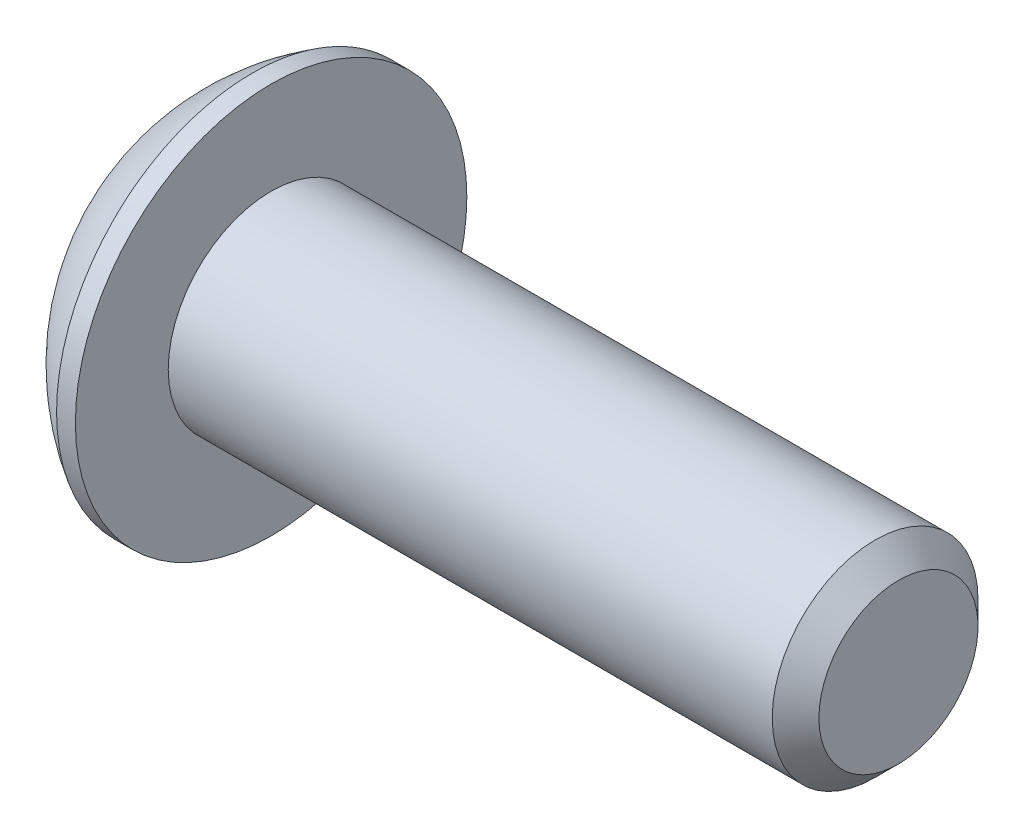
ISO-10303-21;
HEADER;
FILE_DESCRIPTION(('STEP AP214'),'2;1');
FILE_NAME('part.step','',(''),(''),'','','');
FILE_SCHEMA(('AUTOMOTIVE_DESIGN { 1 0 10303 214 1 1 1 1 }'));
ENDSEC;
DATA;
#1=APPLICATION_CONTEXT('core data for automotive mechanical design processes');
#2=APPLICATION_PROTOCOL_DEFINITION('international standard','automotive_design',2000,#1);
#3=PRODUCT_CONTEXT('',#1,'mechanical');
#4=PRODUCT('Part','Part','',(#3));
#5=PRODUCT_RELATED_PRODUCT_CATEGORY('part','',(#4));
#6=PRODUCT_DEFINITION_FORMATION('','',#4);
#7=PRODUCT_DEFINITION_CONTEXT('part definition',#1,'design');
#8=PRODUCT_DEFINITION('design','',#6,#7);
#9=PRODUCT_DEFINITION_SHAPE('','',#8);
#10=(LENGTH_UNIT() NAMED_UNIT(*) SI_UNIT(.MILLI.,.METRE.));
#11=(NAMED_UNIT(*) PLANE_ANGLE_UNIT() SI_UNIT($,.RADIAN.));
#12=(NAMED_UNIT(*) SI_UNIT($,.STERADIAN.) SOLID_ANGLE_UNIT());
#13=UNCERTAINTY_MEASURE_WITH_UNIT(LENGTH_MEASURE(1.E-05),#10,'distance_accuracy_value','');
#14=(GEOMETRIC_REPRESENTATION_CONTEXT(3) GLOBAL_UNCERTAINTY_ASSIGNED_CONTEXT((#13)) GLOBAL_UNIT_ASSIGNED_CONTEXT((#10,
#11,#12)) REPRESENTATION_CONTEXT('',''));
#15=CARTESIAN_POINT('',(0.,0.,0.));
#16=DIRECTION('',(0.,0.,1.));
#17=DIRECTION('',(1.,0.,0.));
#18=AXIS2_PLACEMENT_3D('',#15,#16,#17);
#19=CARTESIAN_POINT('',(1.32080000000034,0.,0.));
#20=DIRECTION('',(-1.,0.,0.));
#21=DIRECTION('',(0.,0.,1.));
#22=AXIS2_PLACEMENT_3D('',#19,#20,#21);
#23=CONICAL_SURFACE('',#22,1.1937999999998,1.04719755119608);
#24=CARTESIAN_POINT('',(2.01004075135902,0.,4.44089209850063E-13));
#25=VERTEX_POINT('',#24);
#26=VERTEX_LOOP('',#25);
#27=FACE_BOUND('',#26,.T.);
#28=CARTESIAN_POINT('',(1.32080000000009,0.,0.));
#29=DIRECTION('',(-1.,0.,0.));
#30=DIRECTION('',(0.,0.,1.));
#31=AXIS2_PLACEMENT_3D('',#28,#29,#30);
#32=CIRCLE('',#31,1.19380000000024);
#33=CARTESIAN_POINT('',(1.32080000000004,0.,1.19380000000012));
#34=VERTEX_POINT('',#33);
#35=CARTESIAN_POINT('',(1.32080000000004,-1.03386112703797,0.596900000000061));
#36=VERTEX_POINT('',#35);
#37=EDGE_CURVE('E20',#34,#36,#32,.F.);
#38=ORIENTED_EDGE('',*,*,#37,.F.);
#39=CARTESIAN_POINT('',(1.32080000000009,0.,0.));
#40=DIRECTION('',(-1.,0.,0.));
#41=DIRECTION('',(0.,0.,1.));
#42=AXIS2_PLACEMENT_3D('',#39,#40,#41);
#43=CIRCLE('',#42,1.19380000000024);
#44=CARTESIAN_POINT('',(1.32080000000004,1.03386112703797,0.596900000000063));
#45=VERTEX_POINT('',#44);
#46=EDGE_CURVE('E90',#45,#34,#43,.F.);
#47=ORIENTED_EDGE('',*,*,#46,.F.);
#48=CARTESIAN_POINT('',(1.32080000000009,0.,0.));
#49=DIRECTION('',(-1.,0.,0.));
#50=DIRECTION('',(0.,0.,1.));
#51=AXIS2_PLACEMENT_3D('',#48,#49,#50);
#52=CIRCLE('',#51,1.19380000000024);
#53=CARTESIAN_POINT('',(1.32080000000004,1.03386112703797,-0.596900000000063));
#54=VERTEX_POINT('',#53);
#55=EDGE_CURVE('E106',#54,#45,#52,.F.);
#56=ORIENTED_EDGE('',*,*,#55,.F.);
#57=CARTESIAN_POINT('',(1.32080000000009,0.,0.));
#58=DIRECTION('',(-1.,0.,0.));
#59=DIRECTION('',(0.,0.,1.));
#60=AXIS2_PLACEMENT_3D('',#57,#58,#59);
#61=CIRCLE('',#60,1.19380000000024);
#62=CARTESIAN_POINT('',(1.32080000000004,1.49420287879031E-12,-1.19380000000012));
#63=VERTEX_POINT('',#62);
#64=EDGE_CURVE('E404',#63,#54,#61,.F.);
#65=ORIENTED_EDGE('',*,*,#64,.F.);
#66=CARTESIAN_POINT('',(1.32080000000009,0.,0.));
#67=DIRECTION('',(-1.,0.,0.));
#68=DIRECTION('',(0.,0.,1.));
#69=AXIS2_PLACEMENT_3D('',#66,#67,#68);
#70=CIRCLE('',#69,1.19380000000024);
#71=CARTESIAN_POINT('',(1.32080000000004,-1.03386112703797,-0.596900000000062));
#72=VERTEX_POINT('',#71);
#73=EDGE_CURVE('E407',#72,#63,#70,.F.);
#74=ORIENTED_EDGE('',*,*,#73,.F.);
#75=CARTESIAN_POINT('',(1.32080000000009,0.,0.));
#76=DIRECTION('',(-1.,0.,0.));
#77=DIRECTION('',(0.,0.,1.));
#78=AXIS2_PLACEMENT_3D('',#75,#76,#77);
#79=CIRCLE('',#78,1.19380000000024);
#80=EDGE_CURVE('E93',#36,#72,#79,.F.);
#81=ORIENTED_EDGE('',*,*,#80,.F.);
#82=EDGE_LOOP('',(#38,#47,#56,#65,#74,#81));
#83=FACE_BOUND('',#82,.T.);
#84=ADVANCED_FACE('F17',(#27,#83),#23,.F.);
#85=CARTESIAN_POINT('',(1.3208,0.,2.3876));
#86=DIRECTION('',(-1.,0.,0.));
#87=DIRECTION('',(0.,0.,1.));
#88=AXIS2_PLACEMENT_3D('',#85,#86,#87);
#89=PLANE('',#88);
#90=DIRECTION('',(0.,1.,0.));
#91=VECTOR('',#90,1.);
#92=CARTESIAN_POINT('',(1.3208,-0.689240751358576,1.1938));
#93=LINE('',#92,#91);
#94=CARTESIAN_POINT('',(1.3208,-0.689240751358576,1.1938));
#95=VERTEX_POINT('',#94);
#96=EDGE_CURVE('E109',#34,#95,#93,.F.);
#97=ORIENTED_EDGE('',*,*,#96,.F.);
#98=ORIENTED_EDGE('',*,*,#37,.T.);
#99=DIRECTION('',(0.,0.5,0.866025403784439));
#100=VECTOR('',#99,1.);
#101=CARTESIAN_POINT('',(1.3208,-1.37848150271715,0.));
#102=LINE('',#101,#100);
#103=EDGE_CURVE('E112',#95,#36,#102,.F.);
#104=ORIENTED_EDGE('',*,*,#103,.F.);
#105=EDGE_LOOP('',(#97,#98,#104));
#106=FACE_BOUND('',#105,.T.);
#107=ADVANCED_FACE('F110',(#106),#89,.T.);
#108=CARTESIAN_POINT('',(1.3208,0.,2.3876));
#109=DIRECTION('',(-1.,0.,0.));
#110=DIRECTION('',(0.,0.,1.));
#111=AXIS2_PLACEMENT_3D('',#108,#109,#110);
#112=PLANE('',#111);
#113=DIRECTION('',(0.,0.5,0.866025403784439));
#114=VECTOR('',#113,1.);
#115=CARTESIAN_POINT('',(1.3208,-1.37848150271715,0.));
#116=LINE('',#115,#114);
#117=CARTESIAN_POINT('',(1.3208,-1.37848150271715,0.));
#118=VERTEX_POINT('',#117);
#119=EDGE_CURVE('E172',#36,#118,#116,.F.);
#120=ORIENTED_EDGE('',*,*,#119,.F.);
#121=ORIENTED_EDGE('',*,*,#80,.T.);
#122=DIRECTION('',(0.,-0.5,0.866025403784439));
#123=VECTOR('',#122,1.);
#124=CARTESIAN_POINT('',(1.3208,-0.689240751358576,-1.1938));
#125=LINE('',#124,#123);
#126=EDGE_CURVE('E160',#118,#72,#125,.F.);
#127=ORIENTED_EDGE('',*,*,#126,.F.);
#128=EDGE_LOOP('',(#120,#121,#127));
#129=FACE_BOUND('',#128,.T.);
#130=ADVANCED_FACE('F249',(#129),#112,.T.);
#131=CARTESIAN_POINT('',(1.3208,0.,2.3876));
#132=DIRECTION('',(-1.,0.,0.));
#133=DIRECTION('',(0.,0.,1.));
#134=AXIS2_PLACEMENT_3D('',#131,#132,#133);
#135=PLANE('',#134);
#136=DIRECTION('',(0.,-0.5,0.866025403784439));
#137=VECTOR('',#136,1.);
#138=CARTESIAN_POINT('',(1.3208,-0.689240751358576,-1.1938));
#139=LINE('',#138,#137);
#140=CARTESIAN_POINT('',(1.3208,-0.689240751358576,-1.1938));
#141=VERTEX_POINT('',#140);
#142=EDGE_CURVE('E157',#72,#141,#139,.F.);
#143=ORIENTED_EDGE('',*,*,#142,.F.);
#144=ORIENTED_EDGE('',*,*,#73,.T.);
#145=DIRECTION('',(0.,-1.,0.));
#146=VECTOR('',#145,1.);
#147=CARTESIAN_POINT('',(1.3208,0.689240751358575,-1.1938));
#148=LINE('',#147,#146);
#149=EDGE_CURVE('E144',#141,#63,#148,.F.);
#150=ORIENTED_EDGE('',*,*,#149,.F.);
#151=EDGE_LOOP('',(#143,#144,#150));
#152=FACE_BOUND('',#151,.T.);
#153=ADVANCED_FACE('F245',(#152),#135,.T.);
#154=CARTESIAN_POINT('',(1.3208,0.,2.3876));
#155=DIRECTION('',(-1.,0.,0.));
#156=DIRECTION('',(0.,0.,1.));
#157=AXIS2_PLACEMENT_3D('',#154,#155,#156);
#158=PLANE('',#157);
#159=DIRECTION('',(0.,-1.,0.));
#160=VECTOR('',#159,1.);
#161=CARTESIAN_POINT('',(1.3208,0.689240751358575,-1.1938));
#162=LINE('',#161,#160);
#163=CARTESIAN_POINT('',(1.3208,0.689240751358575,-1.1938));
#164=VERTEX_POINT('',#163);
#165=EDGE_CURVE('E141',#63,#164,#162,.F.);
#166=ORIENTED_EDGE('',*,*,#165,.F.);
#167=ORIENTED_EDGE('',*,*,#64,.T.);
#168=DIRECTION('',(0.,-0.500000000000001,-0.866025403784438));
#169=VECTOR('',#168,1.);
#170=CARTESIAN_POINT('',(1.3208,1.37848150271715,0.));
#171=LINE('',#170,#169);
#172=EDGE_CURVE('E129',#164,#54,#171,.F.);
#173=ORIENTED_EDGE('',*,*,#172,.F.);
#174=EDGE_LOOP('',(#166,#167,#173));
#175=FACE_BOUND('',#174,.T.);
#176=ADVANCED_FACE('F241',(#175),#158,.T.);
#177=CARTESIAN_POINT('',(1.3208,0.,2.3876));
#178=DIRECTION('',(-1.,0.,0.));
#179=DIRECTION('',(0.,0.,1.));
#180=AXIS2_PLACEMENT_3D('',#177,#178,#179);
#181=PLANE('',#180);
#182=DIRECTION('',(0.,-0.500000000000001,-0.866025403784438));
#183=VECTOR('',#182,1.);
#184=CARTESIAN_POINT('',(1.3208,1.37848150271715,0.));
#185=LINE('',#184,#183);
#186=CARTESIAN_POINT('',(1.3208,1.37848150271715,0.));
#187=VERTEX_POINT('',#186);
#188=EDGE_CURVE('E126',#54,#187,#185,.F.);
#189=ORIENTED_EDGE('',*,*,#188,.F.);
#190=ORIENTED_EDGE('',*,*,#55,.T.);
#191=DIRECTION('',(0.,0.500000000000001,-0.866025403784438));
#192=VECTOR('',#191,1.);
#193=CARTESIAN_POINT('',(1.3208,0.689240751358575,1.1938));
#194=LINE('',#193,#192);
#195=EDGE_CURVE('E149',#187,#45,#194,.F.);
#196=ORIENTED_EDGE('',*,*,#195,.F.);
#197=EDGE_LOOP('',(#189,#190,#196));
#198=FACE_BOUND('',#197,.T.);
#199=ADVANCED_FACE('F238',(#198),#181,.T.);
#200=CARTESIAN_POINT('',(1.3208,0.,2.3876));
#201=DIRECTION('',(-1.,0.,0.));
#202=DIRECTION('',(0.,0.,1.));
#203=AXIS2_PLACEMENT_3D('',#200,#201,#202);
#204=PLANE('',#203);
#205=DIRECTION('',(0.,0.500000000000001,-0.866025403784438));
#206=VECTOR('',#205,1.);
#207=CARTESIAN_POINT('',(1.3208,0.689240751358575,1.1938));
#208=LINE('',#207,#206);
#209=CARTESIAN_POINT('',(1.3208,0.689240751358575,1.1938));
#210=VERTEX_POINT('',#209);
#211=EDGE_CURVE('E104',#45,#210,#208,.F.);
#212=ORIENTED_EDGE('',*,*,#211,.F.);
#213=ORIENTED_EDGE('',*,*,#46,.T.);
#214=DIRECTION('',(0.,1.,0.));
#215=VECTOR('',#214,1.);
#216=CARTESIAN_POINT('',(1.3208,-0.689240751358576,1.1938));
#217=LINE('',#216,#215);
#218=EDGE_CURVE('E101',#210,#34,#217,.F.);
#219=ORIENTED_EDGE('',*,*,#218,.F.);
#220=EDGE_LOOP('',(#212,#213,#219));
#221=FACE_BOUND('',#220,.T.);
#222=ADVANCED_FACE('F99',(#221),#204,.T.);
#223=CARTESIAN_POINT('',(1.3208,-0.689240751358576,1.1938));
#224=DIRECTION('',(0.,0.,-1.));
#225=DIRECTION('',(0.,1.,0.));
#226=AXIS2_PLACEMENT_3D('',#223,#224,#225);
#227=PLANE('',#226);
#228=DIRECTION('',(0.,1.,0.));
#229=VECTOR('',#228,1.);
#230=CARTESIAN_POINT('',(0.,0.,1.1938));
#231=LINE('',#230,#229);
#232=CARTESIAN_POINT('',(0.,0.689240751358575,1.1938));
#233=VERTEX_POINT('',#232);
#234=CARTESIAN_POINT('',(0.,-0.689240751358576,1.1938));
#235=VERTEX_POINT('',#234);
#236=EDGE_CURVE('E133',#233,#235,#231,.F.);
#237=ORIENTED_EDGE('',*,*,#236,.F.);
#238=DIRECTION('',(1.,0.,0.));
#239=VECTOR('',#238,1.);
#240=CARTESIAN_POINT('',(1.3208,0.689240751358575,1.1938));
#241=LINE('',#240,#239);
#242=EDGE_CURVE('E118',#210,#233,#241,.F.);
#243=ORIENTED_EDGE('',*,*,#242,.F.);
#244=ORIENTED_EDGE('',*,*,#218,.T.);
#245=ORIENTED_EDGE('',*,*,#96,.T.);
#246=DIRECTION('',(1.,0.,0.));
#247=VECTOR('',#246,1.);
#248=CARTESIAN_POINT('',(1.3208,-0.689240751358576,1.1938));
#249=LINE('',#248,#247);
#250=EDGE_CURVE('E169',#235,#95,#249,.T.);
#251=ORIENTED_EDGE('',*,*,#250,.F.);
#252=EDGE_LOOP('',(#237,#243,#244,#245,#251));
#253=FACE_BOUND('',#252,.T.);
#254=ADVANCED_FACE('F116',(#253),#227,.T.);
#255=CARTESIAN_POINT('',(1.3208,-1.37848150271715,0.));
#256=DIRECTION('',(0.,0.866025403784439,-0.5));
#257=DIRECTION('',(0.,0.5,0.866025403784439));
#258=AXIS2_PLACEMENT_3D('',#255,#256,#257);
#259=PLANE('',#258);
#260=DIRECTION('',(0.,-0.5,-0.866025403784439));
#261=VECTOR('',#260,1.);
#262=CARTESIAN_POINT('',(0.,-0.689240751358576,1.1938));
#263=LINE('',#262,#261);
#264=CARTESIAN_POINT('',(0.,-1.37848150271715,0.));
#265=VERTEX_POINT('',#264);
#266=EDGE_CURVE('E391',#235,#265,#263,.T.);
#267=ORIENTED_EDGE('',*,*,#266,.F.);
#268=ORIENTED_EDGE('',*,*,#250,.T.);
#269=ORIENTED_EDGE('',*,*,#103,.T.);
#270=ORIENTED_EDGE('',*,*,#119,.T.);
#271=DIRECTION('',(1.,0.,0.));
#272=VECTOR('',#271,1.);
#273=CARTESIAN_POINT('',(1.3208,-1.37848150271715,0.));
#274=LINE('',#273,#272);
#275=EDGE_CURVE('E154',#265,#118,#274,.T.);
#276=ORIENTED_EDGE('',*,*,#275,.F.);
#277=EDGE_LOOP('',(#267,#268,#269,#270,#276));
#278=FACE_BOUND('',#277,.T.);
#279=ADVANCED_FACE('F229',(#278),#259,.T.);
#280=CARTESIAN_POINT('',(1.3208,-0.689240751358576,-1.1938));
#281=DIRECTION('',(0.,0.866025403784439,0.5));
#282=DIRECTION('',(0.,-0.5,0.866025403784439));
#283=AXIS2_PLACEMENT_3D('',#280,#281,#282);
#284=PLANE('',#283);
#285=DIRECTION('',(0.,0.5,-0.866025403784439));
#286=VECTOR('',#285,1.);
#287=CARTESIAN_POINT('',(0.,-1.37848150271715,0.));
#288=LINE('',#287,#286);
#289=CARTESIAN_POINT('',(0.,-0.689240751358576,-1.1938));
#290=VERTEX_POINT('',#289);
#291=EDGE_CURVE('E388',#265,#290,#288,.T.);
#292=ORIENTED_EDGE('',*,*,#291,.F.);
#293=ORIENTED_EDGE('',*,*,#275,.T.);
#294=ORIENTED_EDGE('',*,*,#126,.T.);
#295=ORIENTED_EDGE('',*,*,#142,.T.);
#296=DIRECTION('',(1.,0.,0.));
#297=VECTOR('',#296,1.);
#298=CARTESIAN_POINT('',(1.3208,-0.689240751358576,-1.1938));
#299=LINE('',#298,#297);
#300=EDGE_CURVE('E138',#290,#141,#299,.T.);
#301=ORIENTED_EDGE('',*,*,#300,.F.);
#302=EDGE_LOOP('',(#292,#293,#294,#295,#301));
#303=FACE_BOUND('',#302,.T.);
#304=ADVANCED_FACE('F225',(#303),#284,.T.);
#305=CARTESIAN_POINT('',(1.3208,0.689240751358575,-1.1938));
#306=DIRECTION('',(0.,0.,1.));
#307=DIRECTION('',(0.,-1.,0.));
#308=AXIS2_PLACEMENT_3D('',#305,#306,#307);
#309=PLANE('',#308);
#310=DIRECTION('',(0.,1.,0.));
#311=VECTOR('',#310,1.);
#312=CARTESIAN_POINT('',(0.,0.,-1.1938));
#313=LINE('',#312,#311);
#314=CARTESIAN_POINT('',(0.,0.689240751358575,-1.1938));
#315=VERTEX_POINT('',#314);
#316=EDGE_CURVE('E385',#290,#315,#313,.T.);
#317=ORIENTED_EDGE('',*,*,#316,.F.);
#318=ORIENTED_EDGE('',*,*,#300,.T.);
#319=ORIENTED_EDGE('',*,*,#149,.T.);
#320=ORIENTED_EDGE('',*,*,#165,.T.);
#321=DIRECTION('',(1.,0.,0.));
#322=VECTOR('',#321,1.);
#323=CARTESIAN_POINT('',(1.3208,0.689240751358575,-1.1938));
#324=LINE('',#323,#322);
#325=EDGE_CURVE('E128',#315,#164,#324,.T.);
#326=ORIENTED_EDGE('',*,*,#325,.F.);
#327=EDGE_LOOP('',(#317,#318,#319,#320,#326));
#328=FACE_BOUND('',#327,.T.);
#329=ADVANCED_FACE('F222',(#328),#309,.T.);
#330=CARTESIAN_POINT('',(1.3208,1.37848150271715,0.));
#331=DIRECTION('',(0.,-0.866025403784438,0.500000000000001));
#332=DIRECTION('',(0.,-0.500000000000001,-0.866025403784438));
#333=AXIS2_PLACEMENT_3D('',#330,#331,#332);
#334=PLANE('',#333);
#335=DIRECTION('',(0.,0.500000000000001,0.866025403784438));
#336=VECTOR('',#335,1.);
#337=CARTESIAN_POINT('',(0.,0.689240751358575,-1.1938));
#338=LINE('',#337,#336);
#339=CARTESIAN_POINT('',(0.,1.37848150271715,0.));
#340=VERTEX_POINT('',#339);
#341=EDGE_CURVE('E382',#315,#340,#338,.T.);
#342=ORIENTED_EDGE('',*,*,#341,.F.);
#343=ORIENTED_EDGE('',*,*,#325,.T.);
#344=ORIENTED_EDGE('',*,*,#172,.T.);
#345=ORIENTED_EDGE('',*,*,#188,.T.);
#346=DIRECTION('',(1.,0.,0.));
#347=VECTOR('',#346,1.);
#348=CARTESIAN_POINT('',(1.3208,1.37848150271715,0.));
#349=LINE('',#348,#347);
#350=EDGE_CURVE('E35',#340,#187,#349,.T.);
#351=ORIENTED_EDGE('',*,*,#350,.F.);
#352=EDGE_LOOP('',(#342,#343,#344,#345,#351));
#353=FACE_BOUND('',#352,.T.);
#354=ADVANCED_FACE('F218',(#353),#334,.T.);
#355=CARTESIAN_POINT('',(1.3208,0.689240751358575,1.1938));
#356=DIRECTION('',(0.,-0.866025403784438,-0.500000000000001));
#357=DIRECTION('',(0.,0.500000000000001,-0.866025403784438));
#358=AXIS2_PLACEMENT_3D('',#355,#356,#357);
#359=PLANE('',#358);
#360=DIRECTION('',(0.,-0.500000000000001,0.866025403784438));
#361=VECTOR('',#360,1.);
#362=CARTESIAN_POINT('',(0.,1.37848150271715,0.));
#363=LINE('',#362,#361);
#364=EDGE_CURVE('E204',#340,#233,#363,.T.);
#365=ORIENTED_EDGE('',*,*,#364,.F.);
#366=ORIENTED_EDGE('',*,*,#350,.T.);
#367=ORIENTED_EDGE('',*,*,#195,.T.);
#368=ORIENTED_EDGE('',*,*,#211,.T.);
#369=ORIENTED_EDGE('',*,*,#242,.T.);
#370=EDGE_LOOP('',(#365,#366,#367,#368,#369));
#371=FACE_BOUND('',#370,.T.);
#372=ADVANCED_FACE('F214',(#371),#359,.T.);
#373=CARTESIAN_POINT('',(0.,0.,0.));
#374=DIRECTION('',(-1.,0.,0.));
#375=DIRECTION('',(0.,0.,1.));
#376=AXIS2_PLACEMENT_3D('',#373,#374,#375);
#377=PLANE('',#376);
#378=ORIENTED_EDGE('',*,*,#341,.T.);
#379=ORIENTED_EDGE('',*,*,#364,.T.);
#380=ORIENTED_EDGE('',*,*,#236,.T.);
#381=ORIENTED_EDGE('',*,*,#266,.T.);
#382=ORIENTED_EDGE('',*,*,#291,.T.);
#383=ORIENTED_EDGE('',*,*,#316,.T.);
#384=EDGE_LOOP('',(#378,#379,#380,#381,#382,#383));
#385=FACE_BOUND('',#384,.T.);
#386=CARTESIAN_POINT('',(0.,1.9812,0.));
#387=CARTESIAN_POINT('',(0.,1.9811996664299,0.0556258831179427));
#388=CARTESIAN_POINT('',(0.,1.97885520380442,0.111261989398606));
#389=CARTESIAN_POINT('',(0.,1.96949260169541,0.222149719830457));
#390=CARTESIAN_POINT('',(0.,1.96247308239605,0.277401225602895));
#391=CARTESIAN_POINT('',(0.,1.94379192841038,0.387209508139748));
#392=CARTESIAN_POINT('',(-1.85322082329397E-13,1.93212292489526,0.441765039546366));
#393=CARTESIAN_POINT('',(1.86340500299935E-13,1.90422331175315,0.549729449347494));
#394=CARTESIAN_POINT('',(6.9454332942222E-13,1.88798900035338,0.60313735920887));
#395=CARTESIAN_POINT('',(1.15501983691781E-12,1.832662144765,0.760839131321828));
#396=CARTESIAN_POINT('',(0.,1.78690023648845,0.862876433575428));
#397=CARTESIAN_POINT('',(0.,1.67887358150667,1.05780719540872));
#398=CARTESIAN_POINT('',(9.54250412037226E-13,1.6166082074585,1.15070030720801));
#399=CARTESIAN_POINT('',(5.94776955847561E-13,1.51224157140982,1.28116890915698));
#400=CARTESIAN_POINT('',(1.6313892700342E-13,1.4755970394354,1.32320451127027));
#401=CARTESIAN_POINT('',(-1.62114692902247E-13,1.39893832619713,1.40400288695709));
#402=CARTESIAN_POINT('',(0.,1.35892742784699,1.44276877695455));
#403=CARTESIAN_POINT('',(1.13761909658717E-13,1.23416504602197,1.55382272417904));
#404=CARTESIAN_POINT('',(0.,1.14466125559859,1.62089527952111));
#405=CARTESIAN_POINT('',(0.,0.955712144178163,1.73902218081179));
#406=CARTESIAN_POINT('',(0.,0.85626719823356,1.79007713076007));
#407=CARTESIAN_POINT('',(0.,0.65020634591084,1.87477637530953));
#408=CARTESIAN_POINT('',(0.,0.543590516134852,1.90842085586266));
#409=CARTESIAN_POINT('',(0.,0.326226155292017,1.95733039300656));
#410=CARTESIAN_POINT('',(0.,0.215477602157928,1.97259535144288));
#411=CARTESIAN_POINT('',(0.,-0.00701040587544747,1.98431697865418));
#412=CARTESIAN_POINT('',(0.,-0.118749860774735,1.98077364742916));
#413=CARTESIAN_POINT('',(0.,-0.340050178355486,1.95497485623824));
#414=CARTESIAN_POINT('',(0.,-0.449611052668256,1.93271949620217));
#415=CARTESIAN_POINT('',(0.,-0.663431110729174,1.87014138774524));
#416=CARTESIAN_POINT('',(0.,-0.767690237838521,1.82981844635272));
#417=CARTESIAN_POINT('',(0.,-0.968005760719347,1.73219968377097));
#418=CARTESIAN_POINT('',(0.,-1.0640618469811,1.6749032225164));
#419=CARTESIAN_POINT('',(0.,-1.19980276751283,1.57757371205873));
#420=CARTESIAN_POINT('',(0.,-1.24366557129213,1.54322665019465));
#421=CARTESIAN_POINT('',(0.,-1.32838995706696,1.47093063174263));
#422=CARTESIAN_POINT('',(0.,-1.36924860178706,1.43297823102439));
#423=CARTESIAN_POINT('',(0.,-1.48674671849223,1.31419842051173));
#424=CARTESIAN_POINT('',(0.,-1.55842832343237,1.22836221289312));
#425=CARTESIAN_POINT('',(0.,-1.6863396856475,1.04586168272493));
#426=CARTESIAN_POINT('',(0.,-1.7425700302488,0.949197771949771));
#427=CARTESIAN_POINT('',(0.,-1.8141614250401,0.79818260029868));
#428=CARTESIAN_POINT('',(0.,-1.83591780585875,0.746776203847788));
#429=CARTESIAN_POINT('',(0.,-1.87500754181092,0.642341081688633));
#430=CARTESIAN_POINT('',(0.,-1.89234447645404,0.589313708122844));
#431=CARTESIAN_POINT('',(0.,-1.92246053433555,0.482076273028393));
#432=CARTESIAN_POINT('',(0.,-1.93524685475118,0.427868224257508));
#433=CARTESIAN_POINT('',(0.,-1.95620937250494,0.31857815184461));
#434=CARTESIAN_POINT('',(0.,-1.96438692958147,0.26349639091287));
#435=CARTESIAN_POINT('',(0.,-1.97388528284653,0.173607715038557));
#436=CARTESIAN_POINT('',(0.,-1.97662743364426,0.138944718024997));
#437=CARTESIAN_POINT('',(0.,-1.98028489645283,0.0695224782566998));
#438=CARTESIAN_POINT('',(0.,-1.98120020846367,0.0347632355019629));
#439=CARTESIAN_POINT('',(0.,-1.9811996664299,-0.0556258831179439));
#440=CARTESIAN_POINT('',(0.,-1.97885520380442,-0.111261989398607));
#441=CARTESIAN_POINT('',(0.,-1.96949260169541,-0.222149719830459));
#442=CARTESIAN_POINT('',(0.,-1.96247308239606,-0.277401225602897));
#443=CARTESIAN_POINT('',(0.,-1.94379192841039,-0.387209508139749));
#444=CARTESIAN_POINT('',(-1.85687495073514E-13,-1.93212292489526,-0.441765039546367));
#445=CARTESIAN_POINT('',(1.86706210197E-13,-1.90422331175315,-0.549729449347495));
#446=CARTESIAN_POINT('',(6.95913223380081E-13,-1.88798900035338,-0.603137359208872));
#447=CARTESIAN_POINT('',(1.15748248033081E-12,-1.83266214476501,-0.760839131321831));
#448=CARTESIAN_POINT('',(0.,-1.78690023648846,-0.862876433575432));
#449=CARTESIAN_POINT('',(0.,-1.67887358150667,-1.05780719540872));
#450=CARTESIAN_POINT('',(9.5413180925305E-13,-1.6166082074585,-1.15070030720801));
#451=CARTESIAN_POINT('',(5.94836334946628E-13,-1.51224157140982,-1.28116890915698));
#452=CARTESIAN_POINT('',(1.63155382486304E-13,-1.4755970394354,-1.32320451127027));
#453=CARTESIAN_POINT('',(-1.62131132519566E-13,-1.39893832619713,-1.40400288695709));
#454=CARTESIAN_POINT('',(0.,-1.35892742784699,-1.44276877695455));
#455=CARTESIAN_POINT('',(1.13774829743125E-13,-1.23416504602197,-1.55382272417904));
#456=CARTESIAN_POINT('',(0.,-1.14466125559859,-1.62089527952111));
#457=CARTESIAN_POINT('',(0.,-0.955712144178159,-1.73902218081179));
#458=CARTESIAN_POINT('',(0.,-0.856267198233559,-1.79007713076007));
#459=CARTESIAN_POINT('',(0.,-0.65020634591084,-1.87477637530954));
#460=CARTESIAN_POINT('',(0.,-0.543590516134851,-1.90842085586267));
#461=CARTESIAN_POINT('',(0.,-0.326226155292015,-1.95733039300656));
#462=CARTESIAN_POINT('',(0.,-0.215477602157927,-1.97259535144288));
#463=CARTESIAN_POINT('',(0.,0.00701040587544891,-1.98431697865418));
#464=CARTESIAN_POINT('',(0.,0.118749860774737,-1.98077364742916));
#465=CARTESIAN_POINT('',(0.,0.340050178355488,-1.95497485623824));
#466=CARTESIAN_POINT('',(0.,0.449611052668257,-1.93271949620217));
#467=CARTESIAN_POINT('',(0.,0.663431110729176,-1.87014138774523));
#468=CARTESIAN_POINT('',(0.,0.767690237838524,-1.82981844635272));
#469=CARTESIAN_POINT('',(0.,0.96800576071935,-1.73219968377097));
#470=CARTESIAN_POINT('',(0.,1.0640618469811,-1.6749032225164));
#471=CARTESIAN_POINT('',(0.,1.19980276751283,-1.57757371205873));
#472=CARTESIAN_POINT('',(0.,1.24366557129213,-1.54322665019465));
#473=CARTESIAN_POINT('',(0.,1.32838995706696,-1.47093063174263));
#474=CARTESIAN_POINT('',(0.,1.36924860178706,-1.43297823102439));
#475=CARTESIAN_POINT('',(0.,1.48674671849223,-1.31419842051172));
#476=CARTESIAN_POINT('',(0.,1.55842832343237,-1.22836221289311));
#477=CARTESIAN_POINT('',(0.,1.6863396856475,-1.04586168272493));
#478=CARTESIAN_POINT('',(0.,1.7425700302488,-0.949197771949772));
#479=CARTESIAN_POINT('',(0.,1.8141614250401,-0.798182600298681));
#480=CARTESIAN_POINT('',(0.,1.83591780585875,-0.746776203847787));
#481=CARTESIAN_POINT('',(0.,1.87500754181092,-0.642341081688632));
#482=CARTESIAN_POINT('',(0.,1.89234447645404,-0.589313708122843));
#483=CARTESIAN_POINT('',(0.,1.92246053433555,-0.482076273028391));
#484=CARTESIAN_POINT('',(0.,1.93524685475118,-0.427868224257506));
#485=CARTESIAN_POINT('',(0.,1.95620937250494,-0.318578151844607));
#486=CARTESIAN_POINT('',(0.,1.96438692958147,-0.263496390912867));
#487=CARTESIAN_POINT('',(0.,1.97388528284654,-0.173607715038555));
#488=CARTESIAN_POINT('',(0.,1.97662743364427,-0.138944718024995));
#489=CARTESIAN_POINT('',(0.,1.98028489645283,-0.0695224782566994));
#490=CARTESIAN_POINT('',(0.,1.98120020846367,-0.0347632355019632));
#491=CARTESIAN_POINT('',(0.,1.9812,0.));
#492=B_SPLINE_CURVE_WITH_KNOTS('',3,(#386,#387,#388,#389,#390,#391,#392,#393,#394,#395,#396,
#397,#398,#399,#400,#401,#402,#403,#404,#405,#406,#407,#408,#409,#410,#411,#412,#413,#414,#415,
#416,#417,#418,#419,#420,#421,#422,#423,#424,#425,#426,#427,#428,#429,#430,#431,#432,#433,#434,
#435,#436,#437,#438,#439,#440,#441,#442,#443,#444,#445,#446,#447,#448,#449,#450,#451,#452,#453,
#454,#455,#456,#457,#458,#459,#460,#461,#462,#463,#464,#465,#466,#467,#468,#469,#470,#471,#472,
#473,#474,#475,#476,#477,#478,#479,#480,#481,#482,#483,#484,#485,#486,#487,#488,#489,#490,#491),
.UNSPECIFIED.,.T.,.F.,(4,2,2,2,2,2,2,2,2,2,2,2,2,2,2,2,2,2,2,2,2,2,2,2,2,2,2,2,2,2,2,2,2,2,2,2,
2,2,2,2,2,2,2,2,2,2,2,2,2,2,2,2,4),(0.,0.166845646007828,0.333740557374255,0.500901034367694,
0.668197445942387,1.00199278686282,1.33580081809885,1.50292354032982,1.6698851310853,
2.00370118900129,2.33750465770544,2.67130456115909,3.00510624723801,3.33890793331696,
3.67270783677065,4.00651130547476,4.34032736339026,4.50728895414554,4.67441167637632,
5.00821970761259,5.34201504853332,5.50931146010827,5.67647193710191,5.84336684846844,
6.0102124944764,6.11448220058334,6.21875190669029,6.38559755269812,6.55249246406454,
6.71965294105798,6.88694935263267,7.22074469355311,7.55455272478914,7.72167544702011,
7.88863703777559,8.22245309569158,8.55625656439573,8.89005646784938,9.2238581539283,
9.55765984000725,9.89145974346094,10.225263212165,10.5590792700806,10.7260408608358,
10.8931635830666,11.2269716143029,11.5607669552236,11.7280633667986,11.8952238437922,
12.0621187551587,12.2289644011667,12.3332341072736,12.4375038133806),.UNSPECIFIED.);
#493=CARTESIAN_POINT('',(0.,1.9812,0.));
#494=VERTEX_POINT('',#493);
#495=EDGE_CURVE('E198',#494,#494,#492,.T.);
#496=ORIENTED_EDGE('',*,*,#495,.F.);
#497=EDGE_LOOP('',(#496));
#498=FACE_BOUND('',#497,.T.);
#499=ADVANCED_FACE('F210',(#385,#498),#377,.T.);
#500=CARTESIAN_POINT('',(4.13385,0.,0.));
#501=DIRECTION('',(0.,1.,0.));
#502=DIRECTION('',(1.,0.,0.));
#503=AXIS2_PLACEMENT_3D('',#500,#501,#502);
#504=SPHERICAL_SURFACE('',#503,4.58408870578439);
#505=CARTESIAN_POINT('',(1.8288,0.,0.));
#506=DIRECTION('',(-1.,0.,0.));
#507=DIRECTION('',(0.,0.,1.));
#508=AXIS2_PLACEMENT_3D('',#505,#506,#507);
#509=CIRCLE('',#508,3.9624);
#510=CARTESIAN_POINT('',(1.8288,0.,3.9624));
#511=VERTEX_POINT('',#510);
#512=EDGE_CURVE('E195',#511,#511,#509,.F.);
#513=ORIENTED_EDGE('',*,*,#512,.F.);
#514=EDGE_LOOP('',(#513));
#515=FACE_BOUND('',#514,.T.);
#516=ORIENTED_EDGE('',*,*,#495,.T.);
#517=EDGE_LOOP('',(#516));
#518=FACE_BOUND('',#517,.T.);
#519=ADVANCED_FACE('F206',(#515,#518),#504,.T.);
#520=CARTESIAN_POINT('',(14.9098,0.,0.));
#521=DIRECTION('',(-1.,0.,0.));
#522=DIRECTION('',(0.,0.,1.));
#523=AXIS2_PLACEMENT_3D('',#520,#521,#522);
#524=PLANE('',#523);
#525=CARTESIAN_POINT('',(14.9098000000549,0.,0.));
#526=DIRECTION('',(-1.,0.,0.));
#527=DIRECTION('',(0.,0.,1.));
#528=AXIS2_PLACEMENT_3D('',#525,#526,#527);
#529=CIRCLE('',#528,1.61036000002923);
#530=CARTESIAN_POINT('',(14.9098000000549,0.,1.61036000002923));
#531=VERTEX_POINT('',#530);
#532=EDGE_CURVE('E192',#531,#531,#529,.T.);
#533=ORIENTED_EDGE('',*,*,#532,.F.);
#534=EDGE_LOOP('',(#533));
#535=FACE_BOUND('',#534,.T.);
#536=ADVANCED_FACE('F277',(#535),#524,.F.);
#537=CARTESIAN_POINT('',(0.,0.,0.));
#538=DIRECTION('',(-1.,0.,0.));
#539=DIRECTION('',(0.,0.,1.));
#540=AXIS2_PLACEMENT_3D('',#537,#538,#539);
#541=CYLINDRICAL_SURFACE('',#540,3.9624);
#542=ORIENTED_EDGE('',*,*,#512,.T.);
#543=EDGE_LOOP('',(#542));
#544=FACE_BOUND('',#543,.T.);
#545=CARTESIAN_POINT('',(2.2098,0.,0.));
#546=DIRECTION('',(-1.,0.,0.));
#547=DIRECTION('',(0.,0.,1.));
#548=AXIS2_PLACEMENT_3D('',#545,#546,#547);
#549=CIRCLE('',#548,3.9624);
#550=CARTESIAN_POINT('',(2.2098,0.,3.9624));
#551=VERTEX_POINT('',#550);
#552=EDGE_CURVE('E189',#551,#551,#549,.T.);
#553=ORIENTED_EDGE('',*,*,#552,.T.);
#554=EDGE_LOOP('',(#553));
#555=FACE_BOUND('',#554,.T.);
#556=ADVANCED_FACE('F274',(#544,#555),#541,.T.);
#557=CARTESIAN_POINT('',(14.4373599999881,0.,0.));
#558=DIRECTION('',(-1.,0.,0.));
#559=DIRECTION('',(0.,0.,1.));
#560=AXIS2_PLACEMENT_3D('',#557,#558,#559);
#561=CONICAL_SURFACE('',#560,2.08280000003924,0.785398163337289);
#562=CARTESIAN_POINT('',(14.43736,0.,0.));
#563=DIRECTION('',(-1.,0.,0.));
#564=DIRECTION('',(0.,0.,1.));
#565=AXIS2_PLACEMENT_3D('',#562,#563,#564);
#566=CIRCLE('',#565,2.0828);
#567=CARTESIAN_POINT('',(14.43736,0.,2.0828));
#568=VERTEX_POINT('',#567);
#569=EDGE_CURVE('E26',#568,#568,#566,.T.);
#570=ORIENTED_EDGE('',*,*,#569,.F.);
#571=EDGE_LOOP('',(#570));
#572=FACE_BOUND('',#571,.T.);
#573=ORIENTED_EDGE('',*,*,#532,.T.);
#574=EDGE_LOOP('',(#573));
#575=FACE_BOUND('',#574,.T.);
#576=ADVANCED_FACE('F267',(#572,#575),#561,.T.);
#577=CARTESIAN_POINT('',(2.2098,2.0828,0.));
#578=DIRECTION('',(-1.,0.,0.));
#579=DIRECTION('',(0.,0.,1.));
#580=AXIS2_PLACEMENT_3D('',#577,#578,#579);
#581=PLANE('',#580);
#582=CARTESIAN_POINT('',(2.2098,0.,0.));
#583=DIRECTION('',(-1.,0.,0.));
#584=DIRECTION('',(0.,0.,1.));
#585=AXIS2_PLACEMENT_3D('',#582,#583,#584);
#586=CIRCLE('',#585,2.0828);
#587=CARTESIAN_POINT('',(2.2098,0.,2.0828));
#588=VERTEX_POINT('',#587);
#589=EDGE_CURVE('E10',#588,#588,#586,.F.);
#590=ORIENTED_EDGE('',*,*,#589,.F.);
#591=EDGE_LOOP('',(#590));
#592=FACE_BOUND('',#591,.T.);
#593=ORIENTED_EDGE('',*,*,#552,.F.);
#594=EDGE_LOOP('',(#593));
#595=FACE_BOUND('',#594,.T.);
#596=ADVANCED_FACE('F261',(#592,#595),#581,.F.);
#597=CARTESIAN_POINT('',(0.,0.,0.));
#598=DIRECTION('',(-1.,0.,0.));
#599=DIRECTION('',(0.,0.,1.));
#600=AXIS2_PLACEMENT_3D('',#597,#598,#599);
#601=CYLINDRICAL_SURFACE('',#600,2.0828);
#602=ORIENTED_EDGE('',*,*,#589,.T.);
#603=EDGE_LOOP('',(#602));
#604=FACE_BOUND('',#603,.T.);
#605=ORIENTED_EDGE('',*,*,#569,.T.);
#606=EDGE_LOOP('',(#605));
#607=FACE_BOUND('',#606,.T.);
#608=ADVANCED_FACE('F259',(#604,#607),#601,.T.);
#609=CLOSED_SHELL('',(#84,#107,#130,#153,#176,#199,#222,#254,#279,#304,#329,#354,#372,#499,#519,
#536,#556,#576,#596,#608));
#610=MANIFOLD_SOLID_BREP('B1',#609);
#611=ADVANCED_BREP_SHAPE_REPRESENTATION('',(#18,#610),#14);
#612=SHAPE_DEFINITION_REPRESENTATION(#9,#611);
ENDSEC;
END-ISO-10303-21;
